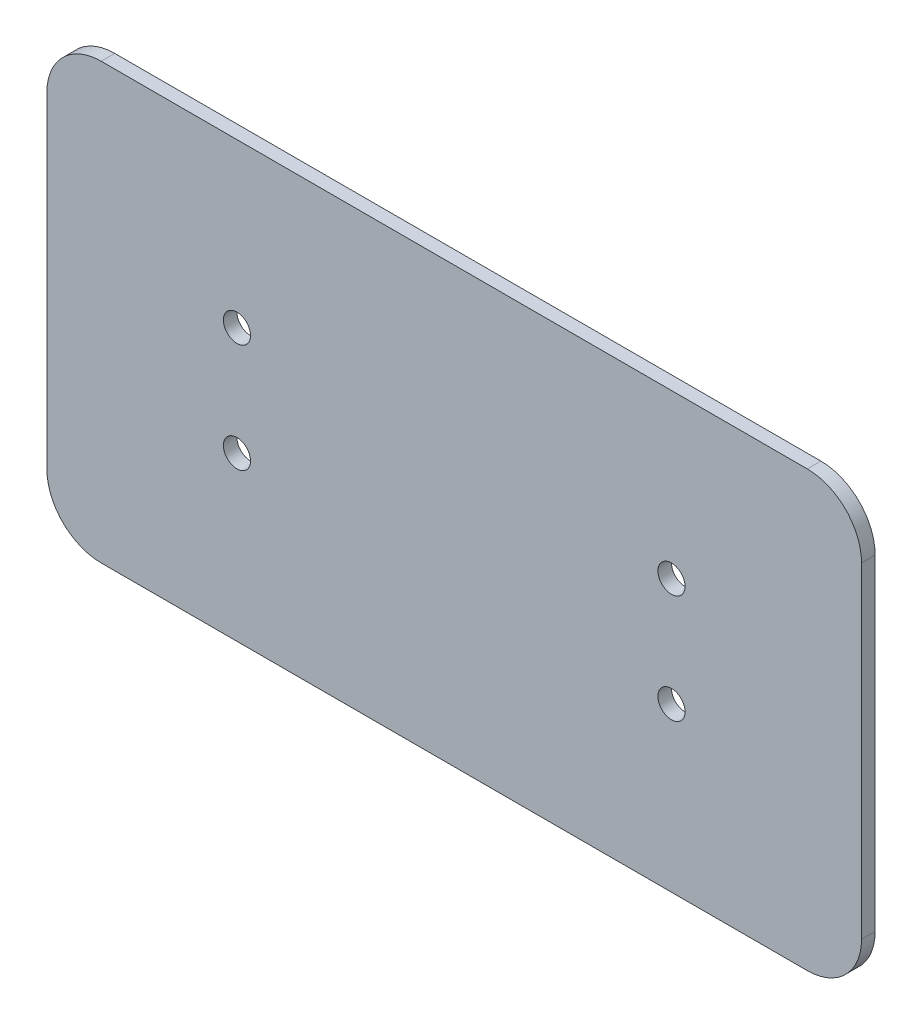
ISO-10303-21;
HEADER;
FILE_DESCRIPTION(('STEP AP214'),'2;1');
FILE_NAME('part.step','',(''),(''),'','','');
FILE_SCHEMA(('AUTOMOTIVE_DESIGN { 1 0 10303 214 1 1 1 1 }'));
ENDSEC;
DATA;
#1=APPLICATION_CONTEXT('core data for automotive mechanical design processes');
#2=APPLICATION_PROTOCOL_DEFINITION('international standard','automotive_design',2000,#1);
#3=PRODUCT_CONTEXT('',#1,'mechanical');
#4=PRODUCT('Part','Part','',(#3));
#5=PRODUCT_RELATED_PRODUCT_CATEGORY('part','',(#4));
#6=PRODUCT_DEFINITION_FORMATION('','',#4);
#7=PRODUCT_DEFINITION_CONTEXT('part definition',#1,'design');
#8=PRODUCT_DEFINITION('design','',#6,#7);
#9=PRODUCT_DEFINITION_SHAPE('','',#8);
#10=(LENGTH_UNIT() NAMED_UNIT(*) SI_UNIT(.MILLI.,.METRE.));
#11=(NAMED_UNIT(*) PLANE_ANGLE_UNIT() SI_UNIT($,.RADIAN.));
#12=(NAMED_UNIT(*) SI_UNIT($,.STERADIAN.) SOLID_ANGLE_UNIT());
#13=UNCERTAINTY_MEASURE_WITH_UNIT(LENGTH_MEASURE(1.E-05),#10,'distance_accuracy_value','');
#14=(GEOMETRIC_REPRESENTATION_CONTEXT(3) GLOBAL_UNCERTAINTY_ASSIGNED_CONTEXT((#13)) GLOBAL_UNIT_ASSIGNED_CONTEXT((#10,
#11,#12)) REPRESENTATION_CONTEXT('',''));
#15=CARTESIAN_POINT('',(0.,0.,0.));
#16=DIRECTION('',(0.,0.,1.));
#17=DIRECTION('',(1.,0.,0.));
#18=AXIS2_PLACEMENT_3D('',#15,#16,#17);
#19=CARTESIAN_POINT('',(0.,-204.758683658735,3.175));
#20=DIRECTION('',(0.,1.,0.));
#21=DIRECTION('',(-1.,0.,0.));
#22=AXIS2_PLACEMENT_3D('',#19,#20,#21);
#23=PLANE('',#22);
#24=DIRECTION('',(1.,0.,0.));
#25=VECTOR('',#24,1.);
#26=CARTESIAN_POINT('',(0.,-204.758683658735,0.));
#27=LINE('',#26,#25);
#28=CARTESIAN_POINT('',(296.179280684031,-204.758683658735,0.));
#29=VERTEX_POINT('',#28);
#30=CARTESIAN_POINT('',(461.279280684031,-204.758683658735,0.));
#31=VERTEX_POINT('',#30);
#32=EDGE_CURVE('E142',#29,#31,#27,.T.);
#33=ORIENTED_EDGE('',*,*,#32,.F.);
#34=DIRECTION('',(0.,0.,-1.));
#35=VECTOR('',#34,1.);
#36=CARTESIAN_POINT('',(296.179280684031,-204.758683658735,3.175));
#37=LINE('',#36,#35);
#38=CARTESIAN_POINT('',(296.179280684031,-204.758683658735,3.175));
#39=VERTEX_POINT('',#38);
#40=EDGE_CURVE('E11',#39,#29,#37,.T.);
#41=ORIENTED_EDGE('',*,*,#40,.F.);
#42=DIRECTION('',(1.,0.,0.));
#43=VECTOR('',#42,1.);
#44=CARTESIAN_POINT('',(0.,-204.758683658735,3.175));
#45=LINE('',#44,#43);
#46=CARTESIAN_POINT('',(461.279280684031,-204.758683658735,3.175));
#47=VERTEX_POINT('',#46);
#48=EDGE_CURVE('E327',#39,#47,#45,.T.);
#49=ORIENTED_EDGE('',*,*,#48,.T.);
#50=DIRECTION('',(0.,0.,-1.));
#51=VECTOR('',#50,1.);
#52=CARTESIAN_POINT('',(461.279280684031,-204.758683658735,3.175));
#53=LINE('',#52,#51);
#54=EDGE_CURVE('E53',#47,#31,#53,.T.);
#55=ORIENTED_EDGE('',*,*,#54,.T.);
#56=EDGE_LOOP('',(#33,#41,#49,#55));
#57=FACE_BOUND('',#56,.T.);
#58=ADVANCED_FACE('F36',(#57),#23,.T.);
#59=CARTESIAN_POINT('',(296.179280684031,-217.458683658735,3.175));
#60=DIRECTION('',(0.,0.,-1.));
#61=DIRECTION('',(-1.,0.,0.));
#62=AXIS2_PLACEMENT_3D('',#59,#60,#61);
#63=CYLINDRICAL_SURFACE('',#62,12.7);
#64=CARTESIAN_POINT('',(296.179280684031,-217.458683658735,0.));
#65=DIRECTION('',(0.,0.,1.));
#66=DIRECTION('',(1.,0.,0.));
#67=AXIS2_PLACEMENT_3D('',#64,#65,#66);
#68=CIRCLE('',#67,12.7);
#69=CARTESIAN_POINT('',(283.479280684031,-217.458683658735,0.));
#70=VERTEX_POINT('',#69);
#71=EDGE_CURVE('E144',#29,#70,#68,.T.);
#72=ORIENTED_EDGE('',*,*,#71,.T.);
#73=DIRECTION('',(0.,0.,-1.));
#74=VECTOR('',#73,1.);
#75=CARTESIAN_POINT('',(283.479280684031,-217.458683658735,3.175));
#76=LINE('',#75,#74);
#77=CARTESIAN_POINT('',(283.479280684031,-217.458683658735,3.175));
#78=VERTEX_POINT('',#77);
#79=EDGE_CURVE('E45',#78,#70,#76,.T.);
#80=ORIENTED_EDGE('',*,*,#79,.F.);
#81=CARTESIAN_POINT('',(296.179280684031,-217.458683658735,3.175));
#82=DIRECTION('',(0.,0.,1.));
#83=DIRECTION('',(1.,0.,0.));
#84=AXIS2_PLACEMENT_3D('',#81,#82,#83);
#85=CIRCLE('',#84,12.7);
#86=EDGE_CURVE('E323',#39,#78,#85,.T.);
#87=ORIENTED_EDGE('',*,*,#86,.F.);
#88=ORIENTED_EDGE('',*,*,#40,.T.);
#89=EDGE_LOOP('',(#72,#80,#87,#88));
#90=FACE_BOUND('',#89,.T.);
#91=ADVANCED_FACE('F181',(#90),#63,.T.);
#92=CARTESIAN_POINT('',(283.47928068403,2.06512614448549E-13,3.175));
#93=DIRECTION('',(1.,0.,0.));
#94=DIRECTION('',(0.,1.,0.));
#95=AXIS2_PLACEMENT_3D('',#92,#93,#94);
#96=PLANE('',#95);
#97=DIRECTION('',(0.,-1.,0.));
#98=VECTOR('',#97,1.);
#99=CARTESIAN_POINT('',(283.47928068403,2.06512614448549E-13,0.));
#100=LINE('',#99,#98);
#101=CARTESIAN_POINT('',(283.479280684031,-293.658683658735,0.));
#102=VERTEX_POINT('',#101);
#103=EDGE_CURVE('E147',#70,#102,#100,.T.);
#104=ORIENTED_EDGE('',*,*,#103,.T.);
#105=DIRECTION('',(0.,0.,-1.));
#106=VECTOR('',#105,1.);
#107=CARTESIAN_POINT('',(283.479280684031,-293.658683658735,3.175));
#108=LINE('',#107,#106);
#109=CARTESIAN_POINT('',(283.479280684031,-293.658683658735,3.175));
#110=VERTEX_POINT('',#109);
#111=EDGE_CURVE('E169',#110,#102,#108,.T.);
#112=ORIENTED_EDGE('',*,*,#111,.F.);
#113=DIRECTION('',(0.,-1.,0.));
#114=VECTOR('',#113,1.);
#115=CARTESIAN_POINT('',(283.47928068403,2.06512614448549E-13,3.175));
#116=LINE('',#115,#114);
#117=EDGE_CURVE('E177',#78,#110,#116,.T.);
#118=ORIENTED_EDGE('',*,*,#117,.F.);
#119=ORIENTED_EDGE('',*,*,#79,.T.);
#120=EDGE_LOOP('',(#104,#112,#118,#119));
#121=FACE_BOUND('',#120,.T.);
#122=ADVANCED_FACE('F174',(#121),#96,.F.);
#123=CARTESIAN_POINT('',(296.179280684031,-293.658683658735,3.175));
#124=DIRECTION('',(0.,0.,-1.));
#125=DIRECTION('',(-1.,0.,0.));
#126=AXIS2_PLACEMENT_3D('',#123,#124,#125);
#127=CYLINDRICAL_SURFACE('',#126,12.7);
#128=CARTESIAN_POINT('',(296.179280684031,-293.658683658735,0.));
#129=DIRECTION('',(0.,0.,1.));
#130=DIRECTION('',(1.,0.,0.));
#131=AXIS2_PLACEMENT_3D('',#128,#129,#130);
#132=CIRCLE('',#131,12.7);
#133=CARTESIAN_POINT('',(296.179280684031,-306.358683658735,0.));
#134=VERTEX_POINT('',#133);
#135=EDGE_CURVE('E150',#102,#134,#132,.T.);
#136=ORIENTED_EDGE('',*,*,#135,.T.);
#137=DIRECTION('',(0.,0.,-1.));
#138=VECTOR('',#137,1.);
#139=CARTESIAN_POINT('',(296.179280684031,-306.358683658735,3.175));
#140=LINE('',#139,#138);
#141=CARTESIAN_POINT('',(296.179280684031,-306.358683658735,3.175));
#142=VERTEX_POINT('',#141);
#143=EDGE_CURVE('E166',#142,#134,#140,.T.);
#144=ORIENTED_EDGE('',*,*,#143,.F.);
#145=CARTESIAN_POINT('',(296.179280684031,-293.658683658735,3.175));
#146=DIRECTION('',(0.,0.,1.));
#147=DIRECTION('',(1.,0.,0.));
#148=AXIS2_PLACEMENT_3D('',#145,#146,#147);
#149=CIRCLE('',#148,12.7);
#150=EDGE_CURVE('E321',#110,#142,#149,.T.);
#151=ORIENTED_EDGE('',*,*,#150,.F.);
#152=ORIENTED_EDGE('',*,*,#111,.T.);
#153=EDGE_LOOP('',(#136,#144,#151,#152));
#154=FACE_BOUND('',#153,.T.);
#155=ADVANCED_FACE('F237',(#154),#127,.T.);
#156=CARTESIAN_POINT('',(0.,-306.358683658735,3.175));
#157=DIRECTION('',(0.,1.,0.));
#158=DIRECTION('',(0.,0.,1.));
#159=AXIS2_PLACEMENT_3D('',#156,#157,#158);
#160=PLANE('',#159);
#161=DIRECTION('',(1.,0.,0.));
#162=VECTOR('',#161,1.);
#163=CARTESIAN_POINT('',(0.,-306.358683658735,0.));
#164=LINE('',#163,#162);
#165=CARTESIAN_POINT('',(461.279280684031,-306.358683658735,0.));
#166=VERTEX_POINT('',#165);
#167=EDGE_CURVE('E153',#134,#166,#164,.T.);
#168=ORIENTED_EDGE('',*,*,#167,.T.);
#169=DIRECTION('',(0.,0.,-1.));
#170=VECTOR('',#169,1.);
#171=CARTESIAN_POINT('',(461.279280684031,-306.358683658735,3.175));
#172=LINE('',#171,#170);
#173=CARTESIAN_POINT('',(461.279280684031,-306.358683658735,3.175));
#174=VERTEX_POINT('',#173);
#175=EDGE_CURVE('E122',#174,#166,#172,.T.);
#176=ORIENTED_EDGE('',*,*,#175,.F.);
#177=DIRECTION('',(1.,0.,0.));
#178=VECTOR('',#177,1.);
#179=CARTESIAN_POINT('',(0.,-306.358683658735,3.175));
#180=LINE('',#179,#178);
#181=EDGE_CURVE('E111',#142,#174,#180,.T.);
#182=ORIENTED_EDGE('',*,*,#181,.F.);
#183=ORIENTED_EDGE('',*,*,#143,.T.);
#184=EDGE_LOOP('',(#168,#176,#182,#183));
#185=FACE_BOUND('',#184,.T.);
#186=ADVANCED_FACE('F234',(#185),#160,.F.);
#187=CARTESIAN_POINT('',(461.279280684031,-293.658683658735,3.175));
#188=DIRECTION('',(0.,0.,-1.));
#189=DIRECTION('',(-1.,0.,0.));
#190=AXIS2_PLACEMENT_3D('',#187,#188,#189);
#191=CYLINDRICAL_SURFACE('',#190,12.7);
#192=CARTESIAN_POINT('',(461.279280684031,-293.658683658735,0.));
#193=DIRECTION('',(0.,0.,1.));
#194=DIRECTION('',(1.,0.,0.));
#195=AXIS2_PLACEMENT_3D('',#192,#193,#194);
#196=CIRCLE('',#195,12.7);
#197=CARTESIAN_POINT('',(473.979280684031,-293.658683658735,0.));
#198=VERTEX_POINT('',#197);
#199=EDGE_CURVE('E119',#166,#198,#196,.T.);
#200=ORIENTED_EDGE('',*,*,#199,.T.);
#201=DIRECTION('',(0.,0.,-1.));
#202=VECTOR('',#201,1.);
#203=CARTESIAN_POINT('',(473.979280684031,-293.658683658735,3.175));
#204=LINE('',#203,#202);
#205=CARTESIAN_POINT('',(473.979280684031,-293.658683658735,3.175));
#206=VERTEX_POINT('',#205);
#207=EDGE_CURVE('E117',#206,#198,#204,.T.);
#208=ORIENTED_EDGE('',*,*,#207,.F.);
#209=CARTESIAN_POINT('',(461.279280684031,-293.658683658735,3.175));
#210=DIRECTION('',(0.,0.,1.));
#211=DIRECTION('',(1.,0.,0.));
#212=AXIS2_PLACEMENT_3D('',#209,#210,#211);
#213=CIRCLE('',#212,12.7);
#214=EDGE_CURVE('E103',#174,#206,#213,.T.);
#215=ORIENTED_EDGE('',*,*,#214,.F.);
#216=ORIENTED_EDGE('',*,*,#175,.T.);
#217=EDGE_LOOP('',(#200,#208,#215,#216));
#218=FACE_BOUND('',#217,.T.);
#219=ADVANCED_FACE('F118',(#218),#191,.T.);
#220=CARTESIAN_POINT('',(473.97928068403,3.45290492526694E-13,3.175));
#221=DIRECTION('',(1.,0.,0.));
#222=DIRECTION('',(0.,1.,0.));
#223=AXIS2_PLACEMENT_3D('',#220,#221,#222);
#224=PLANE('',#223);
#225=DIRECTION('',(0.,-1.,0.));
#226=VECTOR('',#225,1.);
#227=CARTESIAN_POINT('',(473.97928068403,3.45290492526694E-13,0.));
#228=LINE('',#227,#226);
#229=CARTESIAN_POINT('',(473.979280684031,-217.458683658735,0.));
#230=VERTEX_POINT('',#229);
#231=EDGE_CURVE('E157',#230,#198,#228,.T.);
#232=ORIENTED_EDGE('',*,*,#231,.F.);
#233=DIRECTION('',(0.,0.,-1.));
#234=VECTOR('',#233,1.);
#235=CARTESIAN_POINT('',(473.979280684031,-217.458683658735,3.175));
#236=LINE('',#235,#234);
#237=CARTESIAN_POINT('',(473.979280684031,-217.458683658735,3.175));
#238=VERTEX_POINT('',#237);
#239=EDGE_CURVE('E78',#238,#230,#236,.T.);
#240=ORIENTED_EDGE('',*,*,#239,.F.);
#241=DIRECTION('',(0.,-1.,0.));
#242=VECTOR('',#241,1.);
#243=CARTESIAN_POINT('',(473.97928068403,3.45290492526694E-13,3.175));
#244=LINE('',#243,#242);
#245=EDGE_CURVE('E109',#238,#206,#244,.T.);
#246=ORIENTED_EDGE('',*,*,#245,.T.);
#247=ORIENTED_EDGE('',*,*,#207,.T.);
#248=EDGE_LOOP('',(#232,#240,#246,#247));
#249=FACE_BOUND('',#248,.T.);
#250=ADVANCED_FACE('F124',(#249),#224,.T.);
#251=CARTESIAN_POINT('',(327.929280684031,-268.258683658735,3.175));
#252=DIRECTION('',(0.,0.,-1.));
#253=DIRECTION('',(-1.,0.,0.));
#254=AXIS2_PLACEMENT_3D('',#251,#252,#253);
#255=CYLINDRICAL_SURFACE('',#254,3.17499999999997);
#256=CARTESIAN_POINT('',(327.929280684031,-268.258683658735,3.175));
#257=DIRECTION('',(0.,0.,1.));
#258=DIRECTION('',(1.,0.,0.));
#259=AXIS2_PLACEMENT_3D('',#256,#257,#258);
#260=CIRCLE('',#259,3.17499999999997);
#261=CARTESIAN_POINT('',(331.104280684031,-268.258683658735,3.175));
#262=VERTEX_POINT('',#261);
#263=EDGE_CURVE('E329',#262,#262,#260,.T.);
#264=ORIENTED_EDGE('',*,*,#263,.T.);
#265=EDGE_LOOP('',(#264));
#266=FACE_BOUND('',#265,.T.);
#267=CARTESIAN_POINT('',(327.929280684031,-268.258683658735,0.));
#268=DIRECTION('',(0.,0.,1.));
#269=DIRECTION('',(1.,0.,0.));
#270=AXIS2_PLACEMENT_3D('',#267,#268,#269);
#271=CIRCLE('',#270,3.17499999999997);
#272=CARTESIAN_POINT('',(331.104280684031,-268.258683658735,0.));
#273=VERTEX_POINT('',#272);
#274=EDGE_CURVE('E139',#273,#273,#271,.T.);
#275=ORIENTED_EDGE('',*,*,#274,.F.);
#276=EDGE_LOOP('',(#275));
#277=FACE_BOUND('',#276,.T.);
#278=ADVANCED_FACE('F192',(#266,#277),#255,.F.);
#279=CARTESIAN_POINT('',(327.929280684031,-242.858683658735,3.175));
#280=DIRECTION('',(0.,0.,-1.));
#281=DIRECTION('',(-1.,0.,0.));
#282=AXIS2_PLACEMENT_3D('',#279,#280,#281);
#283=CYLINDRICAL_SURFACE('',#282,3.17499999999997);
#284=CARTESIAN_POINT('',(327.929280684031,-242.858683658735,3.175));
#285=DIRECTION('',(0.,0.,1.));
#286=DIRECTION('',(1.,0.,0.));
#287=AXIS2_PLACEMENT_3D('',#284,#285,#286);
#288=CIRCLE('',#287,3.17499999999997);
#289=CARTESIAN_POINT('',(331.104280684031,-242.858683658735,3.175));
#290=VERTEX_POINT('',#289);
#291=EDGE_CURVE('E332',#290,#290,#288,.T.);
#292=ORIENTED_EDGE('',*,*,#291,.T.);
#293=EDGE_LOOP('',(#292));
#294=FACE_BOUND('',#293,.T.);
#295=CARTESIAN_POINT('',(327.929280684031,-242.858683658735,0.));
#296=DIRECTION('',(0.,0.,1.));
#297=DIRECTION('',(1.,0.,0.));
#298=AXIS2_PLACEMENT_3D('',#295,#296,#297);
#299=CIRCLE('',#298,3.17499999999997);
#300=CARTESIAN_POINT('',(331.104280684031,-242.858683658735,0.));
#301=VERTEX_POINT('',#300);
#302=EDGE_CURVE('E136',#301,#301,#299,.T.);
#303=ORIENTED_EDGE('',*,*,#302,.F.);
#304=EDGE_LOOP('',(#303));
#305=FACE_BOUND('',#304,.T.);
#306=ADVANCED_FACE('F195',(#294,#305),#283,.F.);
#307=CARTESIAN_POINT('',(429.529280684031,-242.858683658735,3.175));
#308=DIRECTION('',(0.,0.,-1.));
#309=DIRECTION('',(-1.,0.,0.));
#310=AXIS2_PLACEMENT_3D('',#307,#308,#309);
#311=CYLINDRICAL_SURFACE('',#310,3.17499999999997);
#312=CARTESIAN_POINT('',(429.529280684031,-242.858683658735,3.175));
#313=DIRECTION('',(0.,0.,1.));
#314=DIRECTION('',(1.,0.,0.));
#315=AXIS2_PLACEMENT_3D('',#312,#313,#314);
#316=CIRCLE('',#315,3.17499999999997);
#317=CARTESIAN_POINT('',(432.704280684031,-242.858683658735,3.175));
#318=VERTEX_POINT('',#317);
#319=EDGE_CURVE('E210',#318,#318,#316,.T.);
#320=ORIENTED_EDGE('',*,*,#319,.T.);
#321=EDGE_LOOP('',(#320));
#322=FACE_BOUND('',#321,.T.);
#323=CARTESIAN_POINT('',(429.529280684031,-242.858683658735,0.));
#324=DIRECTION('',(0.,0.,1.));
#325=DIRECTION('',(1.,0.,0.));
#326=AXIS2_PLACEMENT_3D('',#323,#324,#325);
#327=CIRCLE('',#326,3.17499999999997);
#328=CARTESIAN_POINT('',(432.704280684031,-242.858683658735,0.));
#329=VERTEX_POINT('',#328);
#330=EDGE_CURVE('E133',#329,#329,#327,.T.);
#331=ORIENTED_EDGE('',*,*,#330,.F.);
#332=EDGE_LOOP('',(#331));
#333=FACE_BOUND('',#332,.T.);
#334=ADVANCED_FACE('F198',(#322,#333),#311,.F.);
#335=CARTESIAN_POINT('',(429.529280684031,-268.258683658735,3.175));
#336=DIRECTION('',(0.,0.,-1.));
#337=DIRECTION('',(-1.,0.,0.));
#338=AXIS2_PLACEMENT_3D('',#335,#336,#337);
#339=CYLINDRICAL_SURFACE('',#338,3.17499999999997);
#340=CARTESIAN_POINT('',(429.529280684031,-268.258683658735,3.175));
#341=DIRECTION('',(0.,0.,1.));
#342=DIRECTION('',(1.,0.,0.));
#343=AXIS2_PLACEMENT_3D('',#340,#341,#342);
#344=CIRCLE('',#343,3.17499999999997);
#345=CARTESIAN_POINT('',(432.704280684031,-268.258683658735,3.175));
#346=VERTEX_POINT('',#345);
#347=EDGE_CURVE('E162',#346,#346,#344,.T.);
#348=ORIENTED_EDGE('',*,*,#347,.T.);
#349=EDGE_LOOP('',(#348));
#350=FACE_BOUND('',#349,.T.);
#351=CARTESIAN_POINT('',(429.529280684031,-268.258683658735,0.));
#352=DIRECTION('',(0.,0.,1.));
#353=DIRECTION('',(1.,0.,0.));
#354=AXIS2_PLACEMENT_3D('',#351,#352,#353);
#355=CIRCLE('',#354,3.17499999999997);
#356=CARTESIAN_POINT('',(432.704280684031,-268.258683658735,0.));
#357=VERTEX_POINT('',#356);
#358=EDGE_CURVE('E130',#357,#357,#355,.T.);
#359=ORIENTED_EDGE('',*,*,#358,.F.);
#360=EDGE_LOOP('',(#359));
#361=FACE_BOUND('',#360,.T.);
#362=ADVANCED_FACE('F38',(#350,#361),#339,.F.);
#363=CARTESIAN_POINT('',(461.279280684031,-217.458683658735,3.175));
#364=DIRECTION('',(0.,0.,-1.));
#365=DIRECTION('',(-1.,0.,0.));
#366=AXIS2_PLACEMENT_3D('',#363,#364,#365);
#367=CYLINDRICAL_SURFACE('',#366,12.7);
#368=CARTESIAN_POINT('',(461.279280684031,-217.458683658735,0.));
#369=DIRECTION('',(0.,0.,1.));
#370=DIRECTION('',(1.,0.,0.));
#371=AXIS2_PLACEMENT_3D('',#368,#369,#370);
#372=CIRCLE('',#371,12.7);
#373=EDGE_CURVE('E159',#31,#230,#372,.F.);
#374=ORIENTED_EDGE('',*,*,#373,.F.);
#375=ORIENTED_EDGE('',*,*,#54,.F.);
#376=CARTESIAN_POINT('',(461.279280684031,-217.458683658735,3.175));
#377=DIRECTION('',(0.,0.,1.));
#378=DIRECTION('',(1.,0.,0.));
#379=AXIS2_PLACEMENT_3D('',#376,#377,#378);
#380=CIRCLE('',#379,12.7);
#381=EDGE_CURVE('E125',#47,#238,#380,.F.);
#382=ORIENTED_EDGE('',*,*,#381,.T.);
#383=ORIENTED_EDGE('',*,*,#239,.T.);
#384=EDGE_LOOP('',(#374,#375,#382,#383));
#385=FACE_BOUND('',#384,.T.);
#386=ADVANCED_FACE('F205',(#385),#367,.T.);
#387=CARTESIAN_POINT('',(0.,0.,3.175));
#388=DIRECTION('',(0.,0.,1.));
#389=DIRECTION('',(1.,0.,0.));
#390=AXIS2_PLACEMENT_3D('',#387,#388,#389);
#391=PLANE('',#390);
#392=ORIENTED_EDGE('',*,*,#347,.F.);
#393=EDGE_LOOP('',(#392));
#394=FACE_BOUND('',#393,.T.);
#395=ORIENTED_EDGE('',*,*,#319,.F.);
#396=EDGE_LOOP('',(#395));
#397=FACE_BOUND('',#396,.T.);
#398=ORIENTED_EDGE('',*,*,#291,.F.);
#399=EDGE_LOOP('',(#398));
#400=FACE_BOUND('',#399,.T.);
#401=ORIENTED_EDGE('',*,*,#263,.F.);
#402=EDGE_LOOP('',(#401));
#403=FACE_BOUND('',#402,.T.);
#404=ORIENTED_EDGE('',*,*,#48,.F.);
#405=ORIENTED_EDGE('',*,*,#86,.T.);
#406=ORIENTED_EDGE('',*,*,#117,.T.);
#407=ORIENTED_EDGE('',*,*,#150,.T.);
#408=ORIENTED_EDGE('',*,*,#181,.T.);
#409=ORIENTED_EDGE('',*,*,#214,.T.);
#410=ORIENTED_EDGE('',*,*,#245,.F.);
#411=ORIENTED_EDGE('',*,*,#381,.F.);
#412=EDGE_LOOP('',(#404,#405,#406,#407,#408,#409,#410,#411));
#413=FACE_BOUND('',#412,.T.);
#414=ADVANCED_FACE('F106',(#394,#397,#400,#403,#413),#391,.T.);
#415=CARTESIAN_POINT('',(0.,0.,0.));
#416=DIRECTION('',(0.,0.,1.));
#417=DIRECTION('',(1.,0.,0.));
#418=AXIS2_PLACEMENT_3D('',#415,#416,#417);
#419=PLANE('',#418);
#420=ORIENTED_EDGE('',*,*,#358,.T.);
#421=EDGE_LOOP('',(#420));
#422=FACE_BOUND('',#421,.T.);
#423=ORIENTED_EDGE('',*,*,#330,.T.);
#424=EDGE_LOOP('',(#423));
#425=FACE_BOUND('',#424,.T.);
#426=ORIENTED_EDGE('',*,*,#302,.T.);
#427=EDGE_LOOP('',(#426));
#428=FACE_BOUND('',#427,.T.);
#429=ORIENTED_EDGE('',*,*,#274,.T.);
#430=EDGE_LOOP('',(#429));
#431=FACE_BOUND('',#430,.T.);
#432=ORIENTED_EDGE('',*,*,#32,.T.);
#433=ORIENTED_EDGE('',*,*,#373,.T.);
#434=ORIENTED_EDGE('',*,*,#231,.T.);
#435=ORIENTED_EDGE('',*,*,#199,.F.);
#436=ORIENTED_EDGE('',*,*,#167,.F.);
#437=ORIENTED_EDGE('',*,*,#135,.F.);
#438=ORIENTED_EDGE('',*,*,#103,.F.);
#439=ORIENTED_EDGE('',*,*,#71,.F.);
#440=EDGE_LOOP('',(#432,#433,#434,#435,#436,#437,#438,#439));
#441=FACE_BOUND('',#440,.T.);
#442=ADVANCED_FACE('F183',(#422,#425,#428,#431,#441),#419,.F.);
#443=CLOSED_SHELL('',(#58,#91,#122,#155,#186,#219,#250,#278,#306,#334,#362,#386,#414,#442));
#444=MANIFOLD_SOLID_BREP('B2',#443);
#445=ADVANCED_BREP_SHAPE_REPRESENTATION('',(#18,#444),#14);
#446=SHAPE_DEFINITION_REPRESENTATION(#9,#445);
ENDSEC;
END-ISO-10303-21;
